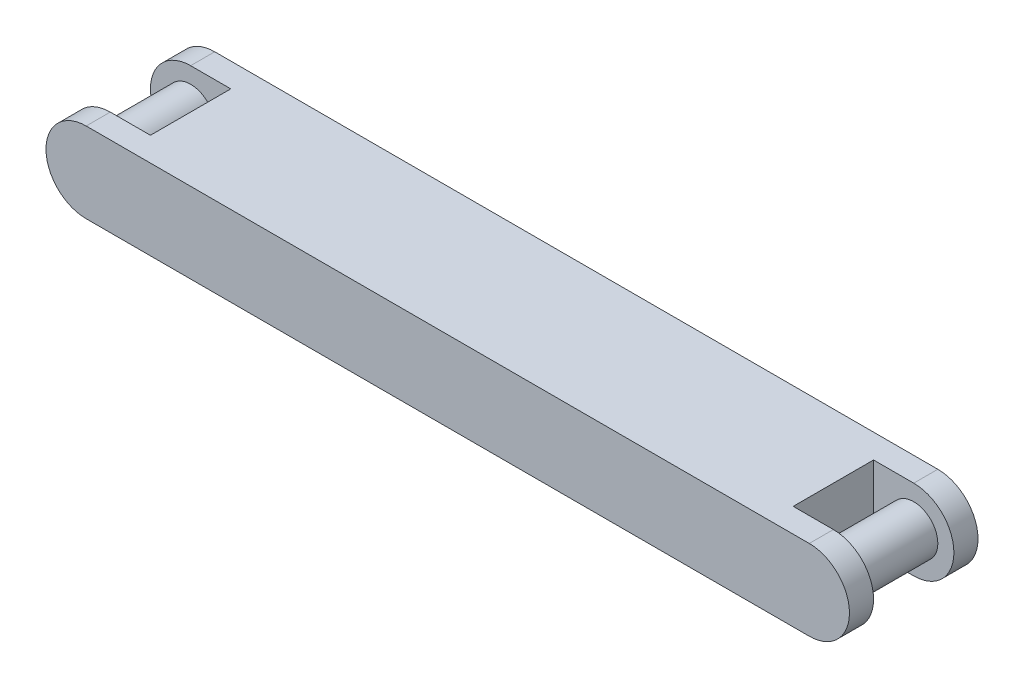
ISO-10303-21;
HEADER;
FILE_DESCRIPTION(('STEP AP214'),'2;1');
FILE_NAME('part.step','',(''),(''),'','','');
FILE_SCHEMA(('AUTOMOTIVE_DESIGN { 1 0 10303 214 1 1 1 1 }'));
ENDSEC;
DATA;
#1=APPLICATION_CONTEXT('core data for automotive mechanical design processes');
#2=APPLICATION_PROTOCOL_DEFINITION('international standard','automotive_design',2000,#1);
#3=PRODUCT_CONTEXT('',#1,'mechanical');
#4=PRODUCT('Part','Part','',(#3));
#5=PRODUCT_RELATED_PRODUCT_CATEGORY('part','',(#4));
#6=PRODUCT_DEFINITION_FORMATION('','',#4);
#7=PRODUCT_DEFINITION_CONTEXT('part definition',#1,'design');
#8=PRODUCT_DEFINITION('design','',#6,#7);
#9=PRODUCT_DEFINITION_SHAPE('','',#8);
#10=(LENGTH_UNIT() NAMED_UNIT(*) SI_UNIT(.MILLI.,.METRE.));
#11=(NAMED_UNIT(*) PLANE_ANGLE_UNIT() SI_UNIT($,.RADIAN.));
#12=(NAMED_UNIT(*) SI_UNIT($,.STERADIAN.) SOLID_ANGLE_UNIT());
#13=UNCERTAINTY_MEASURE_WITH_UNIT(LENGTH_MEASURE(1.E-05),#10,'distance_accuracy_value','');
#14=(GEOMETRIC_REPRESENTATION_CONTEXT(3) GLOBAL_UNCERTAINTY_ASSIGNED_CONTEXT((#13)) GLOBAL_UNIT_ASSIGNED_CONTEXT((#10,
#11,#12)) REPRESENTATION_CONTEXT('',''));
#15=CARTESIAN_POINT('',(0.,0.,0.));
#16=DIRECTION('',(0.,0.,1.));
#17=DIRECTION('',(1.,0.,0.));
#18=AXIS2_PLACEMENT_3D('',#15,#16,#17);
#19=CARTESIAN_POINT('',(127.,0.,-25.4));
#20=DIRECTION('',(1.,0.,0.));
#21=DIRECTION('',(0.,0.,-1.));
#22=AXIS2_PLACEMENT_3D('',#19,#20,#21);
#23=PLANE('',#22);
#24=DIRECTION('',(0.,1.,0.));
#25=VECTOR('',#24,1.);
#26=CARTESIAN_POINT('',(127.,0.,-15.875));
#27=LINE('',#26,#25);
#28=CARTESIAN_POINT('',(127.,-15.875,-15.875));
#29=VERTEX_POINT('',#28);
#30=CARTESIAN_POINT('',(127.,15.875,-15.875));
#31=VERTEX_POINT('',#30);
#32=EDGE_CURVE('E118',#29,#31,#27,.T.);
#33=ORIENTED_EDGE('',*,*,#32,.T.);
#34=DIRECTION('',(0.,0.,1.));
#35=VECTOR('',#34,1.);
#36=CARTESIAN_POINT('',(127.,15.875,-25.4));
#37=LINE('',#36,#35);
#38=CARTESIAN_POINT('',(127.,15.875,15.875));
#39=VERTEX_POINT('',#38);
#40=EDGE_CURVE('E209',#31,#39,#37,.T.);
#41=ORIENTED_EDGE('',*,*,#40,.T.);
#42=DIRECTION('',(0.,-1.,0.));
#43=VECTOR('',#42,1.);
#44=CARTESIAN_POINT('',(127.,0.,15.875));
#45=LINE('',#44,#43);
#46=CARTESIAN_POINT('',(127.,-15.875,15.875));
#47=VERTEX_POINT('',#46);
#48=EDGE_CURVE('E248',#39,#47,#45,.T.);
#49=ORIENTED_EDGE('',*,*,#48,.T.);
#50=DIRECTION('',(0.,0.,1.));
#51=VECTOR('',#50,1.);
#52=CARTESIAN_POINT('',(127.,-15.875,-25.4));
#53=LINE('',#52,#51);
#54=EDGE_CURVE('E114',#29,#47,#53,.T.);
#55=ORIENTED_EDGE('',*,*,#54,.F.);
#56=EDGE_LOOP('',(#33,#41,#49,#55));
#57=FACE_BOUND('',#56,.T.);
#58=ADVANCED_FACE('F99',(#57),#23,.T.);
#59=CARTESIAN_POINT('',(-127.,0.,-25.4));
#60=DIRECTION('',(1.,0.,0.));
#61=DIRECTION('',(0.,0.,-1.));
#62=AXIS2_PLACEMENT_3D('',#59,#60,#61);
#63=PLANE('',#62);
#64=DIRECTION('',(0.,0.,1.));
#65=VECTOR('',#64,1.);
#66=CARTESIAN_POINT('',(-127.,15.875,-25.4));
#67=LINE('',#66,#65);
#68=CARTESIAN_POINT('',(-127.,15.875,-15.875));
#69=VERTEX_POINT('',#68);
#70=CARTESIAN_POINT('',(-127.,15.875,15.875));
#71=VERTEX_POINT('',#70);
#72=EDGE_CURVE('E290',#69,#71,#67,.T.);
#73=ORIENTED_EDGE('',*,*,#72,.F.);
#74=DIRECTION('',(0.,1.,0.));
#75=VECTOR('',#74,1.);
#76=CARTESIAN_POINT('',(-127.,0.,-15.875));
#77=LINE('',#76,#75);
#78=CARTESIAN_POINT('',(-127.,-15.875,-15.875));
#79=VERTEX_POINT('',#78);
#80=EDGE_CURVE('E222',#79,#69,#77,.T.);
#81=ORIENTED_EDGE('',*,*,#80,.F.);
#82=DIRECTION('',(0.,0.,1.));
#83=VECTOR('',#82,1.);
#84=CARTESIAN_POINT('',(-127.,-15.875,-25.4));
#85=LINE('',#84,#83);
#86=CARTESIAN_POINT('',(-127.,-15.875,15.875));
#87=VERTEX_POINT('',#86);
#88=EDGE_CURVE('E107',#79,#87,#85,.T.);
#89=ORIENTED_EDGE('',*,*,#88,.T.);
#90=DIRECTION('',(0.,-1.,0.));
#91=VECTOR('',#90,1.);
#92=CARTESIAN_POINT('',(-127.,0.,15.875));
#93=LINE('',#92,#91);
#94=EDGE_CURVE('E270',#71,#87,#93,.T.);
#95=ORIENTED_EDGE('',*,*,#94,.F.);
#96=EDGE_LOOP('',(#73,#81,#89,#95));
#97=FACE_BOUND('',#96,.T.);
#98=ADVANCED_FACE('F319',(#97),#63,.F.);
#99=CARTESIAN_POINT('',(0.,-15.875,-25.4));
#100=DIRECTION('',(0.,-1.,0.));
#101=DIRECTION('',(0.,0.,-1.));
#102=AXIS2_PLACEMENT_3D('',#99,#100,#101);
#103=PLANE('',#102);
#104=DIRECTION('',(1.,0.,0.));
#105=VECTOR('',#104,1.);
#106=CARTESIAN_POINT('',(0.,-15.875,-25.4));
#107=LINE('',#106,#105);
#108=CARTESIAN_POINT('',(-142.875,-15.875,-25.4));
#109=VERTEX_POINT('',#108);
#110=CARTESIAN_POINT('',(142.875,-15.875,-25.4));
#111=VERTEX_POINT('',#110);
#112=EDGE_CURVE('E285',#109,#111,#107,.T.);
#113=ORIENTED_EDGE('',*,*,#112,.T.);
#114=DIRECTION('',(0.,0.,-1.));
#115=VECTOR('',#114,1.);
#116=CARTESIAN_POINT('',(142.875,-15.875,-15.875));
#117=LINE('',#116,#115);
#118=CARTESIAN_POINT('',(142.875,-15.875,-15.875));
#119=VERTEX_POINT('',#118);
#120=EDGE_CURVE('E205',#119,#111,#117,.T.);
#121=ORIENTED_EDGE('',*,*,#120,.F.);
#122=DIRECTION('',(-1.,0.,0.));
#123=VECTOR('',#122,1.);
#124=CARTESIAN_POINT('',(0.,-15.875,-15.875));
#125=LINE('',#124,#123);
#126=EDGE_CURVE('E194',#119,#29,#125,.T.);
#127=ORIENTED_EDGE('',*,*,#126,.T.);
#128=ORIENTED_EDGE('',*,*,#54,.T.);
#129=DIRECTION('',(1.,0.,0.));
#130=VECTOR('',#129,1.);
#131=CARTESIAN_POINT('',(0.,-15.875,15.875));
#132=LINE('',#131,#130);
#133=CARTESIAN_POINT('',(142.875,-15.875,15.875));
#134=VERTEX_POINT('',#133);
#135=EDGE_CURVE('E245',#47,#134,#132,.T.);
#136=ORIENTED_EDGE('',*,*,#135,.T.);
#137=DIRECTION('',(0.,0.,1.));
#138=VECTOR('',#137,1.);
#139=CARTESIAN_POINT('',(142.875,-15.875,15.875));
#140=LINE('',#139,#138);
#141=CARTESIAN_POINT('',(142.875,-15.875,25.4));
#142=VERTEX_POINT('',#141);
#143=EDGE_CURVE('E250',#134,#142,#140,.T.);
#144=ORIENTED_EDGE('',*,*,#143,.T.);
#145=DIRECTION('',(1.,0.,0.));
#146=VECTOR('',#145,1.);
#147=CARTESIAN_POINT('',(0.,-15.875,25.4));
#148=LINE('',#147,#146);
#149=CARTESIAN_POINT('',(-142.875,-15.875,25.4));
#150=VERTEX_POINT('',#149);
#151=EDGE_CURVE('E281',#150,#142,#148,.T.);
#152=ORIENTED_EDGE('',*,*,#151,.F.);
#153=DIRECTION('',(0.,0.,1.));
#154=VECTOR('',#153,1.);
#155=CARTESIAN_POINT('',(-142.875,-15.875,15.875));
#156=LINE('',#155,#154);
#157=CARTESIAN_POINT('',(-142.875,-15.875,15.875));
#158=VERTEX_POINT('',#157);
#159=EDGE_CURVE('E278',#158,#150,#156,.T.);
#160=ORIENTED_EDGE('',*,*,#159,.F.);
#161=DIRECTION('',(-1.,0.,0.));
#162=VECTOR('',#161,1.);
#163=CARTESIAN_POINT('',(0.,-15.875,15.875));
#164=LINE('',#163,#162);
#165=EDGE_CURVE('E262',#87,#158,#164,.T.);
#166=ORIENTED_EDGE('',*,*,#165,.F.);
#167=ORIENTED_EDGE('',*,*,#88,.F.);
#168=DIRECTION('',(1.,0.,0.));
#169=VECTOR('',#168,1.);
#170=CARTESIAN_POINT('',(0.,-15.875,-15.875));
#171=LINE('',#170,#169);
#172=CARTESIAN_POINT('',(-142.875,-15.875,-15.875));
#173=VERTEX_POINT('',#172);
#174=EDGE_CURVE('E224',#173,#79,#171,.T.);
#175=ORIENTED_EDGE('',*,*,#174,.F.);
#176=DIRECTION('',(0.,0.,-1.));
#177=VECTOR('',#176,1.);
#178=CARTESIAN_POINT('',(-142.875,-15.875,-15.875));
#179=LINE('',#178,#177);
#180=EDGE_CURVE('E228',#173,#109,#179,.T.);
#181=ORIENTED_EDGE('',*,*,#180,.T.);
#182=EDGE_LOOP('',(#113,#121,#127,#128,#136,#144,#152,#160,#166,#167,#175,#181));
#183=FACE_BOUND('',#182,.T.);
#184=ADVANCED_FACE('F101',(#183),#103,.T.);
#185=CARTESIAN_POINT('',(0.,15.875,-25.4));
#186=DIRECTION('',(0.,-1.,0.));
#187=DIRECTION('',(0.,0.,-1.));
#188=AXIS2_PLACEMENT_3D('',#185,#186,#187);
#189=PLANE('',#188);
#190=DIRECTION('',(1.,0.,0.));
#191=VECTOR('',#190,1.);
#192=CARTESIAN_POINT('',(0.,15.875,-25.4));
#193=LINE('',#192,#191);
#194=CARTESIAN_POINT('',(-142.875,15.875,-25.4));
#195=VERTEX_POINT('',#194);
#196=CARTESIAN_POINT('',(142.875,15.875,-25.4));
#197=VERTEX_POINT('',#196);
#198=EDGE_CURVE('E287',#195,#197,#193,.T.);
#199=ORIENTED_EDGE('',*,*,#198,.F.);
#200=DIRECTION('',(0.,0.,-1.));
#201=VECTOR('',#200,1.);
#202=CARTESIAN_POINT('',(-142.875,15.875,-15.875));
#203=LINE('',#202,#201);
#204=CARTESIAN_POINT('',(-142.875,15.875,-15.875));
#205=VERTEX_POINT('',#204);
#206=EDGE_CURVE('E231',#205,#195,#203,.T.);
#207=ORIENTED_EDGE('',*,*,#206,.F.);
#208=DIRECTION('',(1.,0.,0.));
#209=VECTOR('',#208,1.);
#210=CARTESIAN_POINT('',(0.,15.875,-15.875));
#211=LINE('',#210,#209);
#212=EDGE_CURVE('E219',#205,#69,#211,.T.);
#213=ORIENTED_EDGE('',*,*,#212,.T.);
#214=ORIENTED_EDGE('',*,*,#72,.T.);
#215=DIRECTION('',(-1.,0.,0.));
#216=VECTOR('',#215,1.);
#217=CARTESIAN_POINT('',(0.,15.875,15.875));
#218=LINE('',#217,#216);
#219=CARTESIAN_POINT('',(-142.875,15.875,15.875));
#220=VERTEX_POINT('',#219);
#221=EDGE_CURVE('E267',#71,#220,#218,.T.);
#222=ORIENTED_EDGE('',*,*,#221,.T.);
#223=DIRECTION('',(0.,0.,1.));
#224=VECTOR('',#223,1.);
#225=CARTESIAN_POINT('',(-142.875,15.875,15.875));
#226=LINE('',#225,#224);
#227=CARTESIAN_POINT('',(-142.875,15.875,25.4));
#228=VERTEX_POINT('',#227);
#229=EDGE_CURVE('E273',#220,#228,#226,.T.);
#230=ORIENTED_EDGE('',*,*,#229,.T.);
#231=DIRECTION('',(1.,0.,0.));
#232=VECTOR('',#231,1.);
#233=CARTESIAN_POINT('',(0.,15.875,25.4));
#234=LINE('',#233,#232);
#235=CARTESIAN_POINT('',(142.875,15.875,25.4));
#236=VERTEX_POINT('',#235);
#237=EDGE_CURVE('E283',#228,#236,#234,.T.);
#238=ORIENTED_EDGE('',*,*,#237,.T.);
#239=DIRECTION('',(0.,0.,1.));
#240=VECTOR('',#239,1.);
#241=CARTESIAN_POINT('',(142.875,15.875,15.875));
#242=LINE('',#241,#240);
#243=CARTESIAN_POINT('',(142.875,15.875,15.875));
#244=VERTEX_POINT('',#243);
#245=EDGE_CURVE('E255',#244,#236,#242,.T.);
#246=ORIENTED_EDGE('',*,*,#245,.F.);
#247=DIRECTION('',(1.,0.,0.));
#248=VECTOR('',#247,1.);
#249=CARTESIAN_POINT('',(0.,15.875,15.875));
#250=LINE('',#249,#248);
#251=EDGE_CURVE('E240',#39,#244,#250,.T.);
#252=ORIENTED_EDGE('',*,*,#251,.F.);
#253=ORIENTED_EDGE('',*,*,#40,.F.);
#254=DIRECTION('',(-1.,0.,0.));
#255=VECTOR('',#254,1.);
#256=CARTESIAN_POINT('',(0.,15.875,-15.875));
#257=LINE('',#256,#255);
#258=CARTESIAN_POINT('',(142.875,15.875,-15.875));
#259=VERTEX_POINT('',#258);
#260=EDGE_CURVE('E192',#259,#31,#257,.T.);
#261=ORIENTED_EDGE('',*,*,#260,.F.);
#262=DIRECTION('',(0.,0.,-1.));
#263=VECTOR('',#262,1.);
#264=CARTESIAN_POINT('',(142.875,15.875,-15.875));
#265=LINE('',#264,#263);
#266=EDGE_CURVE('E200',#259,#197,#265,.T.);
#267=ORIENTED_EDGE('',*,*,#266,.T.);
#268=EDGE_LOOP('',(#199,#207,#213,#214,#222,#230,#238,#246,#252,#253,#261,#267));
#269=FACE_BOUND('',#268,.T.);
#270=ADVANCED_FACE('F207',(#269),#189,.F.);
#271=CARTESIAN_POINT('',(0.,0.,-25.4));
#272=DIRECTION('',(0.,0.,1.));
#273=DIRECTION('',(1.,0.,0.));
#274=AXIS2_PLACEMENT_3D('',#271,#272,#273);
#275=PLANE('',#274);
#276=ORIENTED_EDGE('',*,*,#112,.F.);
#277=CARTESIAN_POINT('',(-142.875,0.,-25.4));
#278=DIRECTION('',(0.,0.,1.));
#279=DIRECTION('',(1.,0.,0.));
#280=AXIS2_PLACEMENT_3D('',#277,#278,#279);
#281=CIRCLE('',#280,15.875);
#282=EDGE_CURVE('E217',#195,#109,#281,.T.);
#283=ORIENTED_EDGE('',*,*,#282,.F.);
#284=ORIENTED_EDGE('',*,*,#198,.T.);
#285=CARTESIAN_POINT('',(142.875,0.,-25.4));
#286=DIRECTION('',(0.,0.,1.));
#287=DIRECTION('',(1.,0.,0.));
#288=AXIS2_PLACEMENT_3D('',#285,#286,#287);
#289=CIRCLE('',#288,15.875);
#290=EDGE_CURVE('E203',#111,#197,#289,.T.);
#291=ORIENTED_EDGE('',*,*,#290,.F.);
#292=EDGE_LOOP('',(#276,#283,#284,#291));
#293=FACE_BOUND('',#292,.T.);
#294=ADVANCED_FACE('F330',(#293),#275,.F.);
#295=CARTESIAN_POINT('',(0.,0.,25.4));
#296=DIRECTION('',(0.,0.,1.));
#297=DIRECTION('',(1.,0.,0.));
#298=AXIS2_PLACEMENT_3D('',#295,#296,#297);
#299=PLANE('',#298);
#300=ORIENTED_EDGE('',*,*,#151,.T.);
#301=CARTESIAN_POINT('',(142.875,0.,25.4));
#302=DIRECTION('',(0.,0.,1.));
#303=DIRECTION('',(1.,0.,0.));
#304=AXIS2_PLACEMENT_3D('',#301,#302,#303);
#305=CIRCLE('',#304,15.875);
#306=EDGE_CURVE('E239',#142,#236,#305,.T.);
#307=ORIENTED_EDGE('',*,*,#306,.T.);
#308=ORIENTED_EDGE('',*,*,#237,.F.);
#309=CARTESIAN_POINT('',(-142.875,0.,25.4));
#310=DIRECTION('',(0.,0.,1.));
#311=DIRECTION('',(1.,0.,0.));
#312=AXIS2_PLACEMENT_3D('',#309,#310,#311);
#313=CIRCLE('',#312,15.875);
#314=EDGE_CURVE('E261',#228,#150,#313,.T.);
#315=ORIENTED_EDGE('',*,*,#314,.T.);
#316=EDGE_LOOP('',(#300,#307,#308,#315));
#317=FACE_BOUND('',#316,.T.);
#318=ADVANCED_FACE('F309',(#317),#299,.T.);
#319=CARTESIAN_POINT('',(-142.875,0.,15.875));
#320=DIRECTION('',(0.,0.,1.));
#321=DIRECTION('',(1.,0.,0.));
#322=AXIS2_PLACEMENT_3D('',#319,#320,#321);
#323=CYLINDRICAL_SURFACE('',#322,15.875);
#324=ORIENTED_EDGE('',*,*,#314,.F.);
#325=ORIENTED_EDGE('',*,*,#229,.F.);
#326=CARTESIAN_POINT('',(-142.875,0.,15.875));
#327=DIRECTION('',(0.,0.,1.));
#328=DIRECTION('',(1.,0.,0.));
#329=AXIS2_PLACEMENT_3D('',#326,#327,#328);
#330=CIRCLE('',#329,15.875);
#331=EDGE_CURVE('E264',#220,#158,#330,.T.);
#332=ORIENTED_EDGE('',*,*,#331,.T.);
#333=ORIENTED_EDGE('',*,*,#159,.T.);
#334=EDGE_LOOP('',(#324,#325,#332,#333));
#335=FACE_BOUND('',#334,.T.);
#336=ADVANCED_FACE('F307',(#335),#323,.T.);
#337=CARTESIAN_POINT('',(-142.875,0.,15.875));
#338=DIRECTION('',(0.,0.,1.));
#339=DIRECTION('',(1.,0.,0.));
#340=AXIS2_PLACEMENT_3D('',#337,#338,#339);
#341=PLANE('',#340);
#342=CARTESIAN_POINT('',(-142.875,0.,15.875));
#343=DIRECTION('',(0.,0.,1.));
#344=DIRECTION('',(1.,0.,0.));
#345=AXIS2_PLACEMENT_3D('',#342,#343,#344);
#346=CIRCLE('',#345,9.525);
#347=CARTESIAN_POINT('',(-133.35,0.,15.875));
#348=VERTEX_POINT('',#347);
#349=EDGE_CURVE('E258',#348,#348,#346,.T.);
#350=ORIENTED_EDGE('',*,*,#349,.T.);
#351=EDGE_LOOP('',(#350));
#352=FACE_BOUND('',#351,.T.);
#353=ORIENTED_EDGE('',*,*,#165,.T.);
#354=ORIENTED_EDGE('',*,*,#331,.F.);
#355=ORIENTED_EDGE('',*,*,#221,.F.);
#356=ORIENTED_EDGE('',*,*,#94,.T.);
#357=EDGE_LOOP('',(#353,#354,#355,#356));
#358=FACE_BOUND('',#357,.T.);
#359=ADVANCED_FACE('F312',(#352,#358),#341,.F.);
#360=CARTESIAN_POINT('',(-142.875,0.,-25.4));
#361=DIRECTION('',(0.,0.,1.));
#362=DIRECTION('',(1.,0.,0.));
#363=AXIS2_PLACEMENT_3D('',#360,#361,#362);
#364=CYLINDRICAL_SURFACE('',#363,9.525);
#365=CARTESIAN_POINT('',(-142.875,0.,-15.875));
#366=DIRECTION('',(0.,0.,1.));
#367=DIRECTION('',(1.,0.,0.));
#368=AXIS2_PLACEMENT_3D('',#365,#366,#367);
#369=CIRCLE('',#368,9.525);
#370=CARTESIAN_POINT('',(-133.35,0.,-15.875));
#371=VERTEX_POINT('',#370);
#372=EDGE_CURVE('E12',#371,#371,#369,.F.);
#373=ORIENTED_EDGE('',*,*,#372,.F.);
#374=EDGE_LOOP('',(#373));
#375=FACE_BOUND('',#374,.T.);
#376=ORIENTED_EDGE('',*,*,#349,.F.);
#377=EDGE_LOOP('',(#376));
#378=FACE_BOUND('',#377,.T.);
#379=ADVANCED_FACE('F437',(#375,#378),#364,.T.);
#380=CARTESIAN_POINT('',(142.875,0.,15.875));
#381=DIRECTION('',(0.,0.,1.));
#382=DIRECTION('',(1.,0.,0.));
#383=AXIS2_PLACEMENT_3D('',#380,#381,#382);
#384=CYLINDRICAL_SURFACE('',#383,15.875);
#385=ORIENTED_EDGE('',*,*,#306,.F.);
#386=ORIENTED_EDGE('',*,*,#143,.F.);
#387=CARTESIAN_POINT('',(142.875,0.,15.875));
#388=DIRECTION('',(0.,0.,1.));
#389=DIRECTION('',(1.,0.,0.));
#390=AXIS2_PLACEMENT_3D('',#387,#388,#389);
#391=CIRCLE('',#390,15.875);
#392=EDGE_CURVE('E242',#134,#244,#391,.T.);
#393=ORIENTED_EDGE('',*,*,#392,.T.);
#394=ORIENTED_EDGE('',*,*,#245,.T.);
#395=EDGE_LOOP('',(#385,#386,#393,#394));
#396=FACE_BOUND('',#395,.T.);
#397=ADVANCED_FACE('F301',(#396),#384,.T.);
#398=CARTESIAN_POINT('',(142.875,0.,15.875));
#399=DIRECTION('',(0.,0.,1.));
#400=DIRECTION('',(1.,0.,0.));
#401=AXIS2_PLACEMENT_3D('',#398,#399,#400);
#402=PLANE('',#401);
#403=CARTESIAN_POINT('',(142.875,0.,15.875));
#404=DIRECTION('',(0.,0.,1.));
#405=DIRECTION('',(1.,0.,0.));
#406=AXIS2_PLACEMENT_3D('',#403,#404,#405);
#407=CIRCLE('',#406,9.525);
#408=CARTESIAN_POINT('',(152.4,0.,15.875));
#409=VERTEX_POINT('',#408);
#410=EDGE_CURVE('E234',#409,#409,#407,.F.);
#411=ORIENTED_EDGE('',*,*,#410,.F.);
#412=EDGE_LOOP('',(#411));
#413=FACE_BOUND('',#412,.T.);
#414=ORIENTED_EDGE('',*,*,#251,.T.);
#415=ORIENTED_EDGE('',*,*,#392,.F.);
#416=ORIENTED_EDGE('',*,*,#135,.F.);
#417=ORIENTED_EDGE('',*,*,#48,.F.);
#418=EDGE_LOOP('',(#414,#415,#416,#417));
#419=FACE_BOUND('',#418,.T.);
#420=ADVANCED_FACE('F297',(#413,#419),#402,.F.);
#421=CARTESIAN_POINT('',(142.875,0.,-25.4));
#422=DIRECTION('',(0.,0.,1.));
#423=DIRECTION('',(1.,0.,0.));
#424=AXIS2_PLACEMENT_3D('',#421,#422,#423);
#425=CYLINDRICAL_SURFACE('',#424,9.525);
#426=CARTESIAN_POINT('',(142.875,0.,-15.875));
#427=DIRECTION('',(0.,0.,1.));
#428=DIRECTION('',(1.,0.,0.));
#429=AXIS2_PLACEMENT_3D('',#426,#427,#428);
#430=CIRCLE('',#429,9.525);
#431=CARTESIAN_POINT('',(152.4,0.,-15.875));
#432=VERTEX_POINT('',#431);
#433=EDGE_CURVE('E216',#432,#432,#430,.T.);
#434=ORIENTED_EDGE('',*,*,#433,.T.);
#435=EDGE_LOOP('',(#434));
#436=FACE_BOUND('',#435,.T.);
#437=ORIENTED_EDGE('',*,*,#410,.T.);
#438=EDGE_LOOP('',(#437));
#439=FACE_BOUND('',#438,.T.);
#440=ADVANCED_FACE('F389',(#436,#439),#425,.T.);
#441=CARTESIAN_POINT('',(-142.875,0.,-15.875));
#442=DIRECTION('',(0.,0.,1.));
#443=DIRECTION('',(1.,0.,0.));
#444=AXIS2_PLACEMENT_3D('',#441,#442,#443);
#445=PLANE('',#444);
#446=ORIENTED_EDGE('',*,*,#212,.F.);
#447=CARTESIAN_POINT('',(-142.875,0.,-15.875));
#448=DIRECTION('',(0.,0.,1.));
#449=DIRECTION('',(1.,0.,0.));
#450=AXIS2_PLACEMENT_3D('',#447,#448,#449);
#451=CIRCLE('',#450,15.875);
#452=EDGE_CURVE('E226',#205,#173,#451,.T.);
#453=ORIENTED_EDGE('',*,*,#452,.T.);
#454=ORIENTED_EDGE('',*,*,#174,.T.);
#455=ORIENTED_EDGE('',*,*,#80,.T.);
#456=EDGE_LOOP('',(#446,#453,#454,#455));
#457=FACE_BOUND('',#456,.T.);
#458=ORIENTED_EDGE('',*,*,#372,.T.);
#459=EDGE_LOOP('',(#458));
#460=FACE_BOUND('',#459,.T.);
#461=ADVANCED_FACE('F322',(#457,#460),#445,.T.);
#462=CARTESIAN_POINT('',(-142.875,0.,-15.875));
#463=DIRECTION('',(0.,0.,-1.));
#464=DIRECTION('',(-1.,0.,0.));
#465=AXIS2_PLACEMENT_3D('',#462,#463,#464);
#466=CYLINDRICAL_SURFACE('',#465,15.875);
#467=ORIENTED_EDGE('',*,*,#282,.T.);
#468=ORIENTED_EDGE('',*,*,#180,.F.);
#469=ORIENTED_EDGE('',*,*,#452,.F.);
#470=ORIENTED_EDGE('',*,*,#206,.T.);
#471=EDGE_LOOP('',(#467,#468,#469,#470));
#472=FACE_BOUND('',#471,.T.);
#473=ADVANCED_FACE('F328',(#472),#466,.T.);
#474=CARTESIAN_POINT('',(142.875,0.,-15.875));
#475=DIRECTION('',(0.,0.,1.));
#476=DIRECTION('',(1.,0.,0.));
#477=AXIS2_PLACEMENT_3D('',#474,#475,#476);
#478=PLANE('',#477);
#479=ORIENTED_EDGE('',*,*,#32,.F.);
#480=ORIENTED_EDGE('',*,*,#126,.F.);
#481=CARTESIAN_POINT('',(142.875,0.,-15.875));
#482=DIRECTION('',(0.,0.,1.));
#483=DIRECTION('',(1.,0.,0.));
#484=AXIS2_PLACEMENT_3D('',#481,#482,#483);
#485=CIRCLE('',#484,15.875);
#486=EDGE_CURVE('E187',#119,#259,#485,.T.);
#487=ORIENTED_EDGE('',*,*,#486,.T.);
#488=ORIENTED_EDGE('',*,*,#260,.T.);
#489=EDGE_LOOP('',(#479,#480,#487,#488));
#490=FACE_BOUND('',#489,.T.);
#491=ORIENTED_EDGE('',*,*,#433,.F.);
#492=EDGE_LOOP('',(#491));
#493=FACE_BOUND('',#492,.T.);
#494=ADVANCED_FACE('F189',(#490,#493),#478,.T.);
#495=CARTESIAN_POINT('',(142.875,0.,-15.875));
#496=DIRECTION('',(0.,0.,-1.));
#497=DIRECTION('',(-1.,0.,0.));
#498=AXIS2_PLACEMENT_3D('',#495,#496,#497);
#499=CYLINDRICAL_SURFACE('',#498,15.875);
#500=ORIENTED_EDGE('',*,*,#290,.T.);
#501=ORIENTED_EDGE('',*,*,#266,.F.);
#502=ORIENTED_EDGE('',*,*,#486,.F.);
#503=ORIENTED_EDGE('',*,*,#120,.T.);
#504=EDGE_LOOP('',(#500,#501,#502,#503));
#505=FACE_BOUND('',#504,.T.);
#506=ADVANCED_FACE('F201',(#505),#499,.T.);
#507=CLOSED_SHELL('',(#58,#98,#184,#270,#294,#318,#336,#359,#379,#397,#420,#440,#461,#473,#494,#506));
#508=MANIFOLD_SOLID_BREP('B2',#507);
#509=ADVANCED_BREP_SHAPE_REPRESENTATION('',(#18,#508),#14);
#510=SHAPE_DEFINITION_REPRESENTATION(#9,#509);
ENDSEC;
END-ISO-10303-21;
